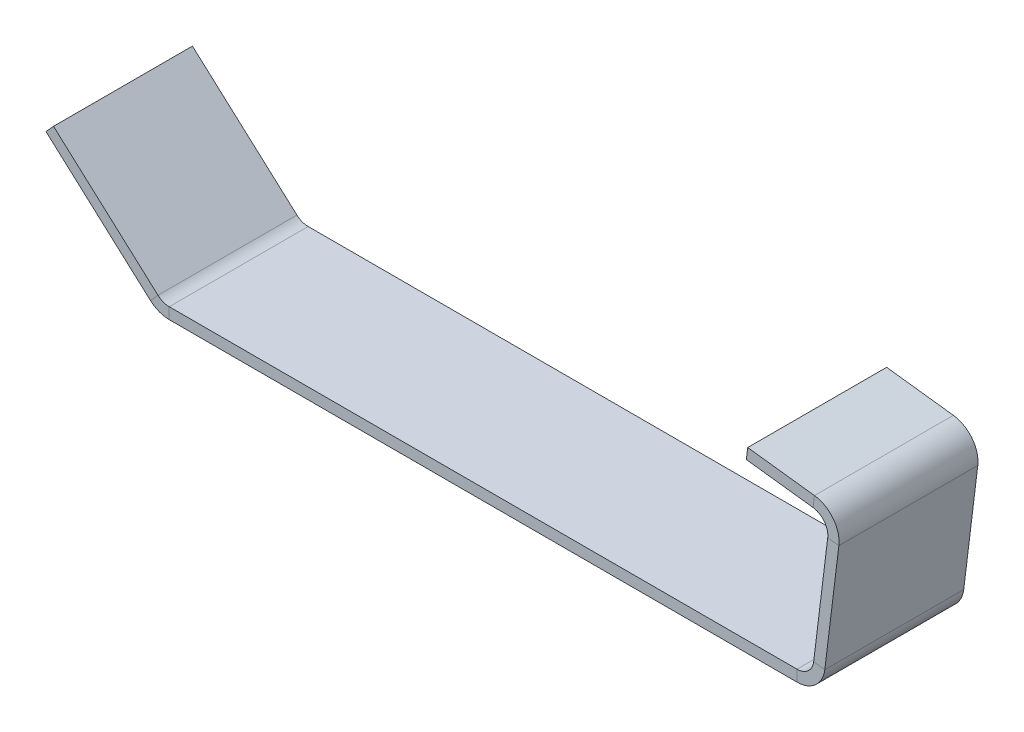
ISO-10303-21;
HEADER;
FILE_DESCRIPTION(('STEP AP214'),'2;1');
FILE_NAME('part.step','',(''),(''),'','','');
FILE_SCHEMA(('AUTOMOTIVE_DESIGN { 1 0 10303 214 1 1 1 1 }'));
ENDSEC;
DATA;
#1=APPLICATION_CONTEXT('core data for automotive mechanical design processes');
#2=APPLICATION_PROTOCOL_DEFINITION('international standard','automotive_design',2000,#1);
#3=PRODUCT_CONTEXT('',#1,'mechanical');
#4=PRODUCT('Part','Part','',(#3));
#5=PRODUCT_RELATED_PRODUCT_CATEGORY('part','',(#4));
#6=PRODUCT_DEFINITION_FORMATION('','',#4);
#7=PRODUCT_DEFINITION_CONTEXT('part definition',#1,'design');
#8=PRODUCT_DEFINITION('design','',#6,#7);
#9=PRODUCT_DEFINITION_SHAPE('','',#8);
#10=(LENGTH_UNIT() NAMED_UNIT(*) SI_UNIT(.MILLI.,.METRE.));
#11=(NAMED_UNIT(*) PLANE_ANGLE_UNIT() SI_UNIT($,.RADIAN.));
#12=(NAMED_UNIT(*) SI_UNIT($,.STERADIAN.) SOLID_ANGLE_UNIT());
#13=UNCERTAINTY_MEASURE_WITH_UNIT(LENGTH_MEASURE(1.E-05),#10,'distance_accuracy_value','');
#14=(GEOMETRIC_REPRESENTATION_CONTEXT(3) GLOBAL_UNCERTAINTY_ASSIGNED_CONTEXT((#13)) GLOBAL_UNIT_ASSIGNED_CONTEXT((#10,
#11,#12)) REPRESENTATION_CONTEXT('',''));
#15=CARTESIAN_POINT('',(0.,0.,0.));
#16=DIRECTION('',(0.,0.,1.));
#17=DIRECTION('',(1.,0.,0.));
#18=AXIS2_PLACEMENT_3D('',#15,#16,#17);
#19=CARTESIAN_POINT('',(0.,-2.,-24.7881355932203));
#20=DIRECTION('',(0.,0.,-1.));
#21=DIRECTION('',(-1.,0.,0.));
#22=AXIS2_PLACEMENT_3D('',#19,#20,#21);
#23=PLANE('',#22);
#24=DIRECTION('',(-1.,0.,0.));
#25=VECTOR('',#24,1.);
#26=CARTESIAN_POINT('',(0.,0.,-24.7881355932203));
#27=LINE('',#26,#25);
#28=CARTESIAN_POINT('',(112.,0.,-24.7881355932203));
#29=VERTEX_POINT('',#28);
#30=CARTESIAN_POINT('',(0.,0.,-24.7881355932203));
#31=VERTEX_POINT('',#30);
#32=EDGE_CURVE('E145',#29,#31,#27,.T.);
#33=ORIENTED_EDGE('',*,*,#32,.F.);
#34=DIRECTION('',(0.,1.,0.));
#35=VECTOR('',#34,1.);
#36=CARTESIAN_POINT('',(112.,-2.,-24.7881355932203));
#37=LINE('',#36,#35);
#38=CARTESIAN_POINT('',(112.,-1.99999999999999,-24.7881355932203));
#39=VERTEX_POINT('',#38);
#40=EDGE_CURVE('E113',#39,#29,#37,.T.);
#41=ORIENTED_EDGE('',*,*,#40,.F.);
#42=DIRECTION('',(-1.,0.,0.));
#43=VECTOR('',#42,1.);
#44=CARTESIAN_POINT('',(0.,-2.,-24.7881355932203));
#45=LINE('',#44,#43);
#46=CARTESIAN_POINT('',(0.,-2.,-24.7881355932203));
#47=VERTEX_POINT('',#46);
#48=EDGE_CURVE('E147',#39,#47,#45,.T.);
#49=ORIENTED_EDGE('',*,*,#48,.T.);
#50=DIRECTION('',(0.,1.,0.));
#51=VECTOR('',#50,1.);
#52=CARTESIAN_POINT('',(0.,-2.,-24.7881355932203));
#53=LINE('',#52,#51);
#54=EDGE_CURVE('E13',#47,#31,#53,.T.);
#55=ORIENTED_EDGE('',*,*,#54,.T.);
#56=EDGE_LOOP('',(#33,#41,#49,#55));
#57=FACE_BOUND('',#56,.T.);
#58=ADVANCED_FACE('F103',(#57),#23,.T.);
#59=CARTESIAN_POINT('',(0.,-2.,0.));
#60=DIRECTION('',(0.,0.,1.));
#61=DIRECTION('',(1.,0.,0.));
#62=AXIS2_PLACEMENT_3D('',#59,#60,#61);
#63=PLANE('',#62);
#64=DIRECTION('',(1.,0.,0.));
#65=VECTOR('',#64,1.);
#66=CARTESIAN_POINT('',(0.,0.,0.));
#67=LINE('',#66,#65);
#68=CARTESIAN_POINT('',(0.,0.,0.));
#69=VERTEX_POINT('',#68);
#70=CARTESIAN_POINT('',(112.,0.,0.));
#71=VERTEX_POINT('',#70);
#72=EDGE_CURVE('E168',#69,#71,#67,.T.);
#73=ORIENTED_EDGE('',*,*,#72,.F.);
#74=DIRECTION('',(0.,1.,0.));
#75=VECTOR('',#74,1.);
#76=CARTESIAN_POINT('',(0.,-2.,0.));
#77=LINE('',#76,#75);
#78=CARTESIAN_POINT('',(0.,-2.,0.));
#79=VERTEX_POINT('',#78);
#80=EDGE_CURVE('E107',#79,#69,#77,.T.);
#81=ORIENTED_EDGE('',*,*,#80,.F.);
#82=DIRECTION('',(1.,0.,0.));
#83=VECTOR('',#82,1.);
#84=CARTESIAN_POINT('',(0.,-2.,0.));
#85=LINE('',#84,#83);
#86=CARTESIAN_POINT('',(112.,-2.,0.));
#87=VERTEX_POINT('',#86);
#88=EDGE_CURVE('E280',#79,#87,#85,.T.);
#89=ORIENTED_EDGE('',*,*,#88,.T.);
#90=DIRECTION('',(0.,1.,0.));
#91=VECTOR('',#90,1.);
#92=CARTESIAN_POINT('',(112.,-2.,0.));
#93=LINE('',#92,#91);
#94=EDGE_CURVE('E289',#87,#71,#93,.T.);
#95=ORIENTED_EDGE('',*,*,#94,.T.);
#96=EDGE_LOOP('',(#73,#81,#89,#95));
#97=FACE_BOUND('',#96,.T.);
#98=ADVANCED_FACE('F105',(#97),#63,.T.);
#99=CARTESIAN_POINT('',(0.,-2.,0.));
#100=DIRECTION('',(0.,-1.,0.));
#101=DIRECTION('',(0.,0.,-1.));
#102=AXIS2_PLACEMENT_3D('',#99,#100,#101);
#103=PLANE('',#102);
#104=DIRECTION('',(0.,0.,1.));
#105=VECTOR('',#104,1.);
#106=CARTESIAN_POINT('',(0.,-2.,0.));
#107=LINE('',#106,#105);
#108=EDGE_CURVE('E122',#47,#79,#107,.T.);
#109=ORIENTED_EDGE('',*,*,#108,.F.);
#110=ORIENTED_EDGE('',*,*,#48,.F.);
#111=DIRECTION('',(0.,0.,-1.));
#112=VECTOR('',#111,1.);
#113=CARTESIAN_POINT('',(112.,-2.,0.));
#114=LINE('',#113,#112);
#115=EDGE_CURVE('E283',#87,#39,#114,.T.);
#116=ORIENTED_EDGE('',*,*,#115,.F.);
#117=ORIENTED_EDGE('',*,*,#88,.F.);
#118=EDGE_LOOP('',(#109,#110,#116,#117));
#119=FACE_BOUND('',#118,.T.);
#120=ADVANCED_FACE('F468',(#119),#103,.T.);
#121=CARTESIAN_POINT('',(0.,0.,0.));
#122=DIRECTION('',(0.,-1.,0.));
#123=DIRECTION('',(0.,0.,-1.));
#124=AXIS2_PLACEMENT_3D('',#121,#122,#123);
#125=PLANE('',#124);
#126=DIRECTION('',(0.,0.,1.));
#127=VECTOR('',#126,1.);
#128=CARTESIAN_POINT('',(0.,0.,0.));
#129=LINE('',#128,#127);
#130=EDGE_CURVE('E155',#31,#69,#129,.T.);
#131=ORIENTED_EDGE('',*,*,#130,.T.);
#132=ORIENTED_EDGE('',*,*,#72,.T.);
#133=DIRECTION('',(0.,0.,-1.));
#134=VECTOR('',#133,1.);
#135=CARTESIAN_POINT('',(112.,0.,0.));
#136=LINE('',#135,#134);
#137=EDGE_CURVE('E140',#71,#29,#136,.T.);
#138=ORIENTED_EDGE('',*,*,#137,.T.);
#139=ORIENTED_EDGE('',*,*,#32,.T.);
#140=EDGE_LOOP('',(#131,#132,#138,#139));
#141=FACE_BOUND('',#140,.T.);
#142=ADVANCED_FACE('F154',(#141),#125,.F.);
#143=CARTESIAN_POINT('',(112.,3.,0.));
#144=DIRECTION('',(0.,0.,1.));
#145=DIRECTION('',(1.,0.,0.));
#146=AXIS2_PLACEMENT_3D('',#143,#144,#145);
#147=PLANE('',#146);
#148=DIRECTION('',(-0.992546151641322,0.121869343405151,0.));
#149=VECTOR('',#148,1.);
#150=CARTESIAN_POINT('',(116.962730758207,2.39065328297424,0.));
#151=LINE('',#150,#149);
#152=CARTESIAN_POINT('',(114.977638454924,2.63439196978455,0.));
#153=VERTEX_POINT('',#152);
#154=CARTESIAN_POINT('',(116.962730758207,2.39065328297424,0.));
#155=VERTEX_POINT('',#154);
#156=EDGE_CURVE('E224',#153,#155,#151,.F.);
#157=ORIENTED_EDGE('',*,*,#156,.F.);
#158=CARTESIAN_POINT('',(112.,3.,0.));
#159=DIRECTION('',(0.,0.,-1.));
#160=DIRECTION('',(-1.,0.,0.));
#161=AXIS2_PLACEMENT_3D('',#158,#159,#160);
#162=CIRCLE('',#161,2.99999999999999);
#163=EDGE_CURVE('E274',#71,#153,#162,.F.);
#164=ORIENTED_EDGE('',*,*,#163,.F.);
#165=ORIENTED_EDGE('',*,*,#94,.F.);
#166=CARTESIAN_POINT('',(112.,3.,0.));
#167=DIRECTION('',(0.,0.,-1.));
#168=DIRECTION('',(-1.,0.,0.));
#169=AXIS2_PLACEMENT_3D('',#166,#167,#168);
#170=CIRCLE('',#169,4.99999999999999);
#171=EDGE_CURVE('E169',#87,#155,#170,.F.);
#172=ORIENTED_EDGE('',*,*,#171,.T.);
#173=EDGE_LOOP('',(#157,#164,#165,#172));
#174=FACE_BOUND('',#173,.T.);
#175=ADVANCED_FACE('F472',(#174),#147,.T.);
#176=CARTESIAN_POINT('',(112.,3.,-24.7881355932203));
#177=DIRECTION('',(0.,0.,1.));
#178=DIRECTION('',(1.,0.,0.));
#179=AXIS2_PLACEMENT_3D('',#176,#177,#178);
#180=PLANE('',#179);
#181=CARTESIAN_POINT('',(112.,3.,-24.7881355932203));
#182=DIRECTION('',(0.,0.,-1.));
#183=DIRECTION('',(-1.,0.,0.));
#184=AXIS2_PLACEMENT_3D('',#181,#182,#183);
#185=CIRCLE('',#184,2.99999999999999);
#186=CARTESIAN_POINT('',(114.977638454924,2.63439196978455,-24.7881355932203));
#187=VERTEX_POINT('',#186);
#188=EDGE_CURVE('E236',#187,#29,#185,.T.);
#189=ORIENTED_EDGE('',*,*,#188,.F.);
#190=DIRECTION('',(-0.992546151641322,0.121869343405151,0.));
#191=VECTOR('',#190,1.);
#192=CARTESIAN_POINT('',(114.977638454924,2.63439196978454,-24.7881355932203));
#193=LINE('',#192,#191);
#194=CARTESIAN_POINT('',(116.962730758207,2.39065328297424,-24.7881355932203));
#195=VERTEX_POINT('',#194);
#196=EDGE_CURVE('E261',#187,#195,#193,.F.);
#197=ORIENTED_EDGE('',*,*,#196,.T.);
#198=CARTESIAN_POINT('',(112.,3.,-24.7881355932203));
#199=DIRECTION('',(0.,0.,-1.));
#200=DIRECTION('',(-1.,0.,0.));
#201=AXIS2_PLACEMENT_3D('',#198,#199,#200);
#202=CIRCLE('',#201,4.99999999999999);
#203=EDGE_CURVE('E271',#195,#39,#202,.T.);
#204=ORIENTED_EDGE('',*,*,#203,.T.);
#205=ORIENTED_EDGE('',*,*,#40,.T.);
#206=EDGE_LOOP('',(#189,#197,#204,#205));
#207=FACE_BOUND('',#206,.T.);
#208=ADVANCED_FACE('F412',(#207),#180,.F.);
#209=CARTESIAN_POINT('',(112.,3.,-24.7881355932203));
#210=DIRECTION('',(0.,0.,-1.));
#211=DIRECTION('',(0.992546151641322,-0.121869343405151,0.));
#212=AXIS2_PLACEMENT_3D('',#209,#210,#211);
#213=CYLINDRICAL_SURFACE('',#212,4.99999999999999);
#214=ORIENTED_EDGE('',*,*,#115,.T.);
#215=ORIENTED_EDGE('',*,*,#203,.F.);
#216=DIRECTION('',(0.,0.,-1.));
#217=VECTOR('',#216,1.);
#218=CARTESIAN_POINT('',(116.962730758207,2.39065328297424,0.));
#219=LINE('',#218,#217);
#220=EDGE_CURVE('E258',#195,#155,#219,.F.);
#221=ORIENTED_EDGE('',*,*,#220,.T.);
#222=ORIENTED_EDGE('',*,*,#171,.F.);
#223=EDGE_LOOP('',(#214,#215,#221,#222));
#224=FACE_BOUND('',#223,.T.);
#225=ADVANCED_FACE('F477',(#224),#213,.T.);
#226=CARTESIAN_POINT('',(112.,3.,-24.7881355932203));
#227=DIRECTION('',(0.,0.,-1.));
#228=DIRECTION('',(0.992546151641322,-0.121869343405151,0.));
#229=AXIS2_PLACEMENT_3D('',#226,#227,#228);
#230=CYLINDRICAL_SURFACE('',#229,2.99999999999999);
#231=ORIENTED_EDGE('',*,*,#137,.F.);
#232=ORIENTED_EDGE('',*,*,#163,.T.);
#233=DIRECTION('',(0.,0.,-1.));
#234=VECTOR('',#233,1.);
#235=CARTESIAN_POINT('',(114.977638454924,2.63439196978455,0.));
#236=LINE('',#235,#234);
#237=EDGE_CURVE('E264',#153,#187,#236,.T.);
#238=ORIENTED_EDGE('',*,*,#237,.T.);
#239=ORIENTED_EDGE('',*,*,#188,.T.);
#240=EDGE_LOOP('',(#231,#232,#238,#239));
#241=FACE_BOUND('',#240,.T.);
#242=ADVANCED_FACE('F405',(#241),#230,.F.);
#243=CARTESIAN_POINT('',(119.470359907908,22.813653791033,-24.7881355932203));
#244=DIRECTION('',(0.,0.,1.));
#245=DIRECTION('',(0.,-1.,0.));
#246=AXIS2_PLACEMENT_3D('',#243,#244,#245);
#247=PLANE('',#246);
#248=ORIENTED_EDGE('',*,*,#196,.F.);
#249=DIRECTION('',(-0.121869343405151,-0.992546151641322,0.));
#250=VECTOR('',#249,1.);
#251=CARTESIAN_POINT('',(117.485267604626,23.0573924778433,-24.7881355932203));
#252=LINE('',#251,#250);
#253=CARTESIAN_POINT('',(117.485267604626,23.0573924778433,-24.7881355932203));
#254=VERTEX_POINT('',#253);
#255=EDGE_CURVE('E255',#187,#254,#252,.F.);
#256=ORIENTED_EDGE('',*,*,#255,.T.);
#257=DIRECTION('',(-0.992546151641322,0.121869343405151,0.));
#258=VECTOR('',#257,1.);
#259=CARTESIAN_POINT('',(119.470359907908,22.813653791033,-24.7881355932203));
#260=LINE('',#259,#258);
#261=CARTESIAN_POINT('',(119.470359907909,22.813653791033,-24.7881355932203));
#262=VERTEX_POINT('',#261);
#263=EDGE_CURVE('E233',#262,#254,#260,.T.);
#264=ORIENTED_EDGE('',*,*,#263,.F.);
#265=DIRECTION('',(0.121869343405151,0.992546151641322,0.));
#266=VECTOR('',#265,1.);
#267=CARTESIAN_POINT('',(114.975828768406,-13.7913648403921,-24.7881355932203));
#268=LINE('',#267,#266);
#269=EDGE_CURVE('E246',#195,#262,#268,.T.);
#270=ORIENTED_EDGE('',*,*,#269,.F.);
#271=EDGE_LOOP('',(#248,#256,#264,#270));
#272=FACE_BOUND('',#271,.T.);
#273=ADVANCED_FACE('F416',(#272),#247,.F.);
#274=CARTESIAN_POINT('',(116.63926809695,-0.243738686810304,0.));
#275=DIRECTION('',(0.,0.,-1.));
#276=DIRECTION('',(-1.,0.,0.));
#277=AXIS2_PLACEMENT_3D('',#274,#275,#276);
#278=PLANE('',#277);
#279=ORIENTED_EDGE('',*,*,#156,.T.);
#280=DIRECTION('',(-0.121869343405151,-0.992546151641322,0.));
#281=VECTOR('',#280,1.);
#282=CARTESIAN_POINT('',(114.975828768406,-13.7913648403921,0.));
#283=LINE('',#282,#281);
#284=CARTESIAN_POINT('',(119.470359907908,22.813653791033,0.));
#285=VERTEX_POINT('',#284);
#286=EDGE_CURVE('E240',#285,#155,#283,.T.);
#287=ORIENTED_EDGE('',*,*,#286,.F.);
#288=DIRECTION('',(-0.992546151641322,0.121869343405151,0.));
#289=VECTOR('',#288,1.);
#290=CARTESIAN_POINT('',(119.470359907908,22.813653791033,0.));
#291=LINE('',#290,#289);
#292=CARTESIAN_POINT('',(117.485267604626,23.0573924778433,0.));
#293=VERTEX_POINT('',#292);
#294=EDGE_CURVE('E237',#285,#293,#291,.T.);
#295=ORIENTED_EDGE('',*,*,#294,.T.);
#296=DIRECTION('',(0.121869343405151,0.992546151641322,0.));
#297=VECTOR('',#296,1.);
#298=CARTESIAN_POINT('',(114.654175793668,0.,0.));
#299=LINE('',#298,#297);
#300=EDGE_CURVE('E249',#293,#153,#299,.F.);
#301=ORIENTED_EDGE('',*,*,#300,.T.);
#302=EDGE_LOOP('',(#279,#287,#295,#301));
#303=FACE_BOUND('',#302,.T.);
#304=ADVANCED_FACE('F430',(#303),#278,.F.);
#305=CARTESIAN_POINT('',(114.975828768406,-13.7913648403921,0.));
#306=DIRECTION('',(-0.992546151641322,0.121869343405151,0.));
#307=DIRECTION('',(-0.121869343405151,-0.992546151641322,0.));
#308=AXIS2_PLACEMENT_3D('',#305,#306,#307);
#309=PLANE('',#308);
#310=ORIENTED_EDGE('',*,*,#220,.F.);
#311=ORIENTED_EDGE('',*,*,#269,.T.);
#312=DIRECTION('',(0.,0.,1.));
#313=VECTOR('',#312,1.);
#314=CARTESIAN_POINT('',(119.470359907908,22.813653791033,0.));
#315=LINE('',#314,#313);
#316=EDGE_CURVE('E243',#262,#285,#315,.T.);
#317=ORIENTED_EDGE('',*,*,#316,.T.);
#318=ORIENTED_EDGE('',*,*,#286,.T.);
#319=EDGE_LOOP('',(#310,#311,#317,#318));
#320=FACE_BOUND('',#319,.T.);
#321=ADVANCED_FACE('F432',(#320),#309,.F.);
#322=CARTESIAN_POINT('',(112.990736465124,-13.5476261535818,0.));
#323=DIRECTION('',(-0.992546151641322,0.121869343405151,0.));
#324=DIRECTION('',(-0.121869343405151,-0.992546151641322,0.));
#325=AXIS2_PLACEMENT_3D('',#322,#323,#324);
#326=PLANE('',#325);
#327=ORIENTED_EDGE('',*,*,#255,.F.);
#328=ORIENTED_EDGE('',*,*,#237,.F.);
#329=ORIENTED_EDGE('',*,*,#300,.F.);
#330=DIRECTION('',(0.,0.,-1.));
#331=VECTOR('',#330,1.);
#332=CARTESIAN_POINT('',(117.485267604626,23.0573924778433,0.));
#333=LINE('',#332,#331);
#334=EDGE_CURVE('E252',#254,#293,#333,.F.);
#335=ORIENTED_EDGE('',*,*,#334,.F.);
#336=EDGE_LOOP('',(#327,#328,#329,#335));
#337=FACE_BOUND('',#336,.T.);
#338=ADVANCED_FACE('F419',(#337),#326,.T.);
#339=CARTESIAN_POINT('',(114.507629149702,23.4230005080588,0.));
#340=DIRECTION('',(0.,0.,1.));
#341=DIRECTION('',(1.,0.,0.));
#342=AXIS2_PLACEMENT_3D('',#339,#340,#341);
#343=PLANE('',#342);
#344=DIRECTION('',(0.121869343405155,0.992546151641321,0.));
#345=VECTOR('',#344,1.);
#346=CARTESIAN_POINT('',(115.116975866728,28.3857312662654,0.));
#347=LINE('',#346,#345);
#348=CARTESIAN_POINT('',(114.873237179917,26.4006389629828,0.));
#349=VERTEX_POINT('',#348);
#350=CARTESIAN_POINT('',(115.116975866728,28.3857312662654,0.));
#351=VERTEX_POINT('',#350);
#352=EDGE_CURVE('E218',#349,#351,#347,.T.);
#353=ORIENTED_EDGE('',*,*,#352,.F.);
#354=CARTESIAN_POINT('',(114.507629149702,23.4230005080588,0.));
#355=DIRECTION('',(0.,0.,-1.));
#356=DIRECTION('',(-1.,0.,0.));
#357=AXIS2_PLACEMENT_3D('',#354,#355,#356);
#358=CIRCLE('',#357,3.);
#359=EDGE_CURVE('E228',#293,#349,#358,.F.);
#360=ORIENTED_EDGE('',*,*,#359,.F.);
#361=ORIENTED_EDGE('',*,*,#294,.F.);
#362=CARTESIAN_POINT('',(114.507629149702,23.4230005080588,0.));
#363=DIRECTION('',(0.,0.,-1.));
#364=DIRECTION('',(-1.,0.,0.));
#365=AXIS2_PLACEMENT_3D('',#362,#363,#364);
#366=CIRCLE('',#365,5.);
#367=EDGE_CURVE('E221',#285,#351,#366,.F.);
#368=ORIENTED_EDGE('',*,*,#367,.T.);
#369=EDGE_LOOP('',(#353,#360,#361,#368));
#370=FACE_BOUND('',#369,.T.);
#371=ADVANCED_FACE('F427',(#370),#343,.T.);
#372=CARTESIAN_POINT('',(114.507629149702,23.4230005080588,-24.7881355932203));
#373=DIRECTION('',(0.,0.,1.));
#374=DIRECTION('',(1.,0.,0.));
#375=AXIS2_PLACEMENT_3D('',#372,#373,#374);
#376=PLANE('',#375);
#377=CARTESIAN_POINT('',(114.507629149702,23.4230005080588,-24.7881355932203));
#378=DIRECTION('',(0.,0.,-1.));
#379=DIRECTION('',(-1.,0.,0.));
#380=AXIS2_PLACEMENT_3D('',#377,#378,#379);
#381=CIRCLE('',#380,3.);
#382=CARTESIAN_POINT('',(114.873237179917,26.4006389629828,-24.7881355932203));
#383=VERTEX_POINT('',#382);
#384=EDGE_CURVE('E187',#383,#254,#381,.T.);
#385=ORIENTED_EDGE('',*,*,#384,.F.);
#386=DIRECTION('',(0.121869343405155,0.992546151641321,0.));
#387=VECTOR('',#386,1.);
#388=CARTESIAN_POINT('',(114.873237179917,26.4006389629828,-24.7881355932203));
#389=LINE('',#388,#387);
#390=CARTESIAN_POINT('',(115.116975866728,28.3857312662654,-24.7881355932203));
#391=VERTEX_POINT('',#390);
#392=EDGE_CURVE('E212',#383,#391,#389,.T.);
#393=ORIENTED_EDGE('',*,*,#392,.T.);
#394=CARTESIAN_POINT('',(114.507629149702,23.4230005080588,-24.7881355932203));
#395=DIRECTION('',(0.,0.,-1.));
#396=DIRECTION('',(-1.,0.,0.));
#397=AXIS2_PLACEMENT_3D('',#394,#395,#396);
#398=CIRCLE('',#397,5.);
#399=EDGE_CURVE('E225',#391,#262,#398,.T.);
#400=ORIENTED_EDGE('',*,*,#399,.T.);
#401=ORIENTED_EDGE('',*,*,#263,.T.);
#402=EDGE_LOOP('',(#385,#393,#400,#401));
#403=FACE_BOUND('',#402,.T.);
#404=ADVANCED_FACE('F436',(#403),#376,.F.);
#405=CARTESIAN_POINT('',(114.507629149702,23.4230005080588,-24.7881355932203));
#406=DIRECTION('',(0.,0.,-1.));
#407=DIRECTION('',(0.121869343405155,0.992546151641321,0.));
#408=AXIS2_PLACEMENT_3D('',#405,#406,#407);
#409=CYLINDRICAL_SURFACE('',#408,5.);
#410=ORIENTED_EDGE('',*,*,#316,.F.);
#411=ORIENTED_EDGE('',*,*,#399,.F.);
#412=DIRECTION('',(0.,0.,-1.));
#413=VECTOR('',#412,1.);
#414=CARTESIAN_POINT('',(115.116975866728,28.3857312662654,1.18458590070572E-13));
#415=LINE('',#414,#413);
#416=EDGE_CURVE('E209',#351,#391,#415,.T.);
#417=ORIENTED_EDGE('',*,*,#416,.F.);
#418=ORIENTED_EDGE('',*,*,#367,.F.);
#419=EDGE_LOOP('',(#410,#411,#417,#418));
#420=FACE_BOUND('',#419,.T.);
#421=ADVANCED_FACE('F434',(#420),#409,.T.);
#422=CARTESIAN_POINT('',(114.507629149702,23.4230005080588,-24.7881355932203));
#423=DIRECTION('',(0.,0.,-1.));
#424=DIRECTION('',(0.121869343405155,0.992546151641321,0.));
#425=AXIS2_PLACEMENT_3D('',#422,#423,#424);
#426=CYLINDRICAL_SURFACE('',#425,3.);
#427=ORIENTED_EDGE('',*,*,#334,.T.);
#428=ORIENTED_EDGE('',*,*,#359,.T.);
#429=DIRECTION('',(0.,0.,1.));
#430=VECTOR('',#429,1.);
#431=CARTESIAN_POINT('',(114.873237179917,26.4006389629828,0.));
#432=LINE('',#431,#430);
#433=EDGE_CURVE('E215',#349,#383,#432,.F.);
#434=ORIENTED_EDGE('',*,*,#433,.T.);
#435=ORIENTED_EDGE('',*,*,#384,.T.);
#436=EDGE_LOOP('',(#427,#428,#434,#435));
#437=FACE_BOUND('',#436,.T.);
#438=ADVANCED_FACE('F422',(#437),#426,.F.);
#439=CARTESIAN_POINT('',(118.094614321652,28.0201232360499,-24.7881355932203));
#440=DIRECTION('',(0.,0.,-1.));
#441=DIRECTION('',(-1.,0.,0.));
#442=AXIS2_PLACEMENT_3D('',#439,#440,#441);
#443=PLANE('',#442);
#444=DIRECTION('',(0.992546151641321,-0.121869343405155,0.));
#445=VECTOR('',#444,1.);
#446=CARTESIAN_POINT('',(118.094614321652,28.0201232360499,-24.7881355932203));
#447=LINE('',#446,#445);
#448=CARTESIAN_POINT('',(103.206422047032,29.8481633871273,-24.7881355932203));
#449=VERTEX_POINT('',#448);
#450=EDGE_CURVE('E191',#449,#391,#447,.T.);
#451=ORIENTED_EDGE('',*,*,#450,.T.);
#452=ORIENTED_EDGE('',*,*,#392,.F.);
#453=DIRECTION('',(-0.992546151641321,0.121869343405155,0.));
#454=VECTOR('',#453,1.);
#455=CARTESIAN_POINT('',(4.89955935186121,39.9037087059789,-24.7881355932199));
#456=LINE('',#455,#454);
#457=CARTESIAN_POINT('',(102.962683360221,27.8630710838446,-24.7881355932203));
#458=VERTEX_POINT('',#457);
#459=EDGE_CURVE('E200',#458,#383,#456,.F.);
#460=ORIENTED_EDGE('',*,*,#459,.F.);
#461=DIRECTION('',(-0.121869343405155,-0.992546151641321,0.));
#462=VECTOR('',#461,1.);
#463=CARTESIAN_POINT('',(103.206422047032,29.8481633871273,-24.7881355932203));
#464=LINE('',#463,#462);
#465=EDGE_CURVE('E184',#449,#458,#464,.T.);
#466=ORIENTED_EDGE('',*,*,#465,.F.);
#467=EDGE_LOOP('',(#451,#452,#460,#466));
#468=FACE_BOUND('',#467,.T.);
#469=ADVANCED_FACE('F445',(#468),#443,.T.);
#470=CARTESIAN_POINT('',(103.206422047032,29.8481633871273,0.));
#471=DIRECTION('',(0.,0.,1.));
#472=DIRECTION('',(1.,0.,0.));
#473=AXIS2_PLACEMENT_3D('',#470,#471,#472);
#474=PLANE('',#473);
#475=DIRECTION('',(0.992546151641321,-0.121869343405155,0.));
#476=VECTOR('',#475,1.);
#477=CARTESIAN_POINT('',(4.89955935186131,39.9037087059789,4.35978058744953E-13));
#478=LINE('',#477,#476);
#479=CARTESIAN_POINT('',(102.962683360221,27.8630710838446,0.));
#480=VERTEX_POINT('',#479);
#481=EDGE_CURVE('E206',#349,#480,#478,.F.);
#482=ORIENTED_EDGE('',*,*,#481,.F.);
#483=ORIENTED_EDGE('',*,*,#352,.T.);
#484=DIRECTION('',(-0.992546151641321,0.121869343405155,0.));
#485=VECTOR('',#484,1.);
#486=CARTESIAN_POINT('',(103.206422047032,29.8481633871273,0.));
#487=LINE('',#486,#485);
#488=CARTESIAN_POINT('',(103.206422047032,29.8481633871273,0.));
#489=VERTEX_POINT('',#488);
#490=EDGE_CURVE('E197',#351,#489,#487,.T.);
#491=ORIENTED_EDGE('',*,*,#490,.T.);
#492=DIRECTION('',(-0.121869343405155,-0.992546151641321,0.));
#493=VECTOR('',#492,1.);
#494=CARTESIAN_POINT('',(103.206422047032,29.8481633871273,0.));
#495=LINE('',#494,#493);
#496=EDGE_CURVE('E188',#489,#480,#495,.T.);
#497=ORIENTED_EDGE('',*,*,#496,.T.);
#498=EDGE_LOOP('',(#482,#483,#491,#497));
#499=FACE_BOUND('',#498,.T.);
#500=ADVANCED_FACE('F452',(#499),#474,.T.);
#501=CARTESIAN_POINT('',(5.14329803867162,41.8888010092616,0.));
#502=DIRECTION('',(0.121869343405155,0.992546151641321,0.));
#503=DIRECTION('',(-0.992546151641321,0.121869343405155,0.));
#504=AXIS2_PLACEMENT_3D('',#501,#502,#503);
#505=PLANE('',#504);
#506=ORIENTED_EDGE('',*,*,#490,.F.);
#507=ORIENTED_EDGE('',*,*,#416,.T.);
#508=ORIENTED_EDGE('',*,*,#450,.F.);
#509=DIRECTION('',(0.,0.,-1.));
#510=VECTOR('',#509,1.);
#511=CARTESIAN_POINT('',(103.206422047032,29.8481633871273,-24.7881355932203));
#512=LINE('',#511,#510);
#513=EDGE_CURVE('E194',#489,#449,#512,.T.);
#514=ORIENTED_EDGE('',*,*,#513,.F.);
#515=EDGE_LOOP('',(#506,#507,#508,#514));
#516=FACE_BOUND('',#515,.T.);
#517=ADVANCED_FACE('F443',(#516),#505,.T.);
#518=CARTESIAN_POINT('',(4.89955935186131,39.9037087059789,0.));
#519=DIRECTION('',(0.121869343405155,0.992546151641321,0.));
#520=DIRECTION('',(-0.992546151641321,0.121869343405155,0.));
#521=AXIS2_PLACEMENT_3D('',#518,#519,#520);
#522=PLANE('',#521);
#523=ORIENTED_EDGE('',*,*,#433,.F.);
#524=ORIENTED_EDGE('',*,*,#481,.T.);
#525=DIRECTION('',(0.,0.,1.));
#526=VECTOR('',#525,1.);
#527=CARTESIAN_POINT('',(102.962683360221,27.8630710838446,0.));
#528=LINE('',#527,#526);
#529=EDGE_CURVE('E203',#480,#458,#528,.F.);
#530=ORIENTED_EDGE('',*,*,#529,.T.);
#531=ORIENTED_EDGE('',*,*,#459,.T.);
#532=EDGE_LOOP('',(#523,#524,#530,#531));
#533=FACE_BOUND('',#532,.T.);
#534=ADVANCED_FACE('F454',(#533),#522,.F.);
#535=CARTESIAN_POINT('',(103.206422047032,29.8481633871273,-24.7881355932203));
#536=DIRECTION('',(-0.992546151641321,0.121869343405155,0.));
#537=DIRECTION('',(-0.121869343405155,-0.992546151641321,0.));
#538=AXIS2_PLACEMENT_3D('',#535,#536,#537);
#539=PLANE('',#538);
#540=ORIENTED_EDGE('',*,*,#529,.F.);
#541=ORIENTED_EDGE('',*,*,#496,.F.);
#542=ORIENTED_EDGE('',*,*,#513,.T.);
#543=ORIENTED_EDGE('',*,*,#465,.T.);
#544=EDGE_LOOP('',(#540,#541,#542,#543));
#545=FACE_BOUND('',#544,.T.);
#546=ADVANCED_FACE('F449',(#545),#539,.T.);
#547=CARTESIAN_POINT('',(0.,3.,-24.7881355932203));
#548=DIRECTION('',(0.,0.,-1.));
#549=DIRECTION('',(-1.,0.,0.));
#550=AXIS2_PLACEMENT_3D('',#547,#548,#549);
#551=PLANE('',#550);
#552=DIRECTION('',(0.669130606358855,0.743144825477397,0.));
#553=VECTOR('',#552,1.);
#554=CARTESIAN_POINT('',(-3.34565303179428,-0.715724127386987,-24.7881355932203));
#555=LINE('',#554,#553);
#556=CARTESIAN_POINT('',(-2.00739181907656,0.770565523567808,-24.7881355932203));
#557=VERTEX_POINT('',#556);
#558=CARTESIAN_POINT('',(-3.34565303179427,-0.715724127386987,-24.7881355932203));
#559=VERTEX_POINT('',#558);
#560=EDGE_CURVE('E174',#557,#559,#555,.F.);
#561=ORIENTED_EDGE('',*,*,#560,.F.);
#562=CARTESIAN_POINT('',(0.,3.,-24.7881355932203));
#563=DIRECTION('',(0.,0.,1.));
#564=DIRECTION('',(1.,0.,0.));
#565=AXIS2_PLACEMENT_3D('',#562,#563,#564);
#566=CIRCLE('',#565,3.);
#567=EDGE_CURVE('E164',#31,#557,#566,.F.);
#568=ORIENTED_EDGE('',*,*,#567,.F.);
#569=ORIENTED_EDGE('',*,*,#54,.F.);
#570=CARTESIAN_POINT('',(0.,3.,-24.7881355932203));
#571=DIRECTION('',(0.,0.,1.));
#572=DIRECTION('',(1.,0.,0.));
#573=AXIS2_PLACEMENT_3D('',#570,#571,#572);
#574=CIRCLE('',#573,5.);
#575=EDGE_CURVE('E178',#47,#559,#574,.F.);
#576=ORIENTED_EDGE('',*,*,#575,.T.);
#577=EDGE_LOOP('',(#561,#568,#569,#576));
#578=FACE_BOUND('',#577,.T.);
#579=ADVANCED_FACE('F172',(#578),#551,.T.);
#580=CARTESIAN_POINT('',(0.,3.,0.));
#581=DIRECTION('',(0.,0.,-1.));
#582=DIRECTION('',(-1.,0.,0.));
#583=AXIS2_PLACEMENT_3D('',#580,#581,#582);
#584=PLANE('',#583);
#585=CARTESIAN_POINT('',(0.,3.,0.));
#586=DIRECTION('',(0.,0.,1.));
#587=DIRECTION('',(1.,0.,0.));
#588=AXIS2_PLACEMENT_3D('',#585,#586,#587);
#589=CIRCLE('',#588,3.);
#590=CARTESIAN_POINT('',(-2.00739181907656,0.770565523567808,0.));
#591=VERTEX_POINT('',#590);
#592=EDGE_CURVE('E167',#591,#69,#589,.T.);
#593=ORIENTED_EDGE('',*,*,#592,.F.);
#594=DIRECTION('',(0.669130606358855,0.743144825477397,0.));
#595=VECTOR('',#594,1.);
#596=CARTESIAN_POINT('',(-2.00739181907656,0.770565523567808,0.));
#597=LINE('',#596,#595);
#598=CARTESIAN_POINT('',(-3.34565303179427,-0.715724127386987,0.));
#599=VERTEX_POINT('',#598);
#600=EDGE_CURVE('E313',#591,#599,#597,.F.);
#601=ORIENTED_EDGE('',*,*,#600,.T.);
#602=CARTESIAN_POINT('',(0.,3.,0.));
#603=DIRECTION('',(0.,0.,1.));
#604=DIRECTION('',(1.,0.,0.));
#605=AXIS2_PLACEMENT_3D('',#602,#603,#604);
#606=CIRCLE('',#605,5.);
#607=EDGE_CURVE('E175',#599,#79,#606,.T.);
#608=ORIENTED_EDGE('',*,*,#607,.T.);
#609=ORIENTED_EDGE('',*,*,#80,.T.);
#610=EDGE_LOOP('',(#593,#601,#608,#609));
#611=FACE_BOUND('',#610,.T.);
#612=ADVANCED_FACE('F294',(#611),#584,.F.);
#613=CARTESIAN_POINT('',(0.,3.,0.));
#614=DIRECTION('',(0.,0.,1.));
#615=DIRECTION('',(-0.669130606358855,-0.743144825477397,0.));
#616=AXIS2_PLACEMENT_3D('',#613,#614,#615);
#617=CYLINDRICAL_SURFACE('',#616,5.);
#618=ORIENTED_EDGE('',*,*,#108,.T.);
#619=ORIENTED_EDGE('',*,*,#607,.F.);
#620=DIRECTION('',(0.,0.,1.));
#621=VECTOR('',#620,1.);
#622=CARTESIAN_POINT('',(-3.34565303179427,-0.715724127386987,0.));
#623=LINE('',#622,#621);
#624=EDGE_CURVE('E308',#559,#599,#623,.T.);
#625=ORIENTED_EDGE('',*,*,#624,.F.);
#626=ORIENTED_EDGE('',*,*,#575,.F.);
#627=EDGE_LOOP('',(#618,#619,#625,#626));
#628=FACE_BOUND('',#627,.T.);
#629=ADVANCED_FACE('F304',(#628),#617,.T.);
#630=CARTESIAN_POINT('',(0.,3.,0.));
#631=DIRECTION('',(0.,0.,1.));
#632=DIRECTION('',(-0.669130606358855,-0.743144825477397,0.));
#633=AXIS2_PLACEMENT_3D('',#630,#631,#632);
#634=CYLINDRICAL_SURFACE('',#633,3.);
#635=ORIENTED_EDGE('',*,*,#130,.F.);
#636=ORIENTED_EDGE('',*,*,#567,.T.);
#637=DIRECTION('',(0.,0.,-1.));
#638=VECTOR('',#637,1.);
#639=CARTESIAN_POINT('',(-2.00739181907656,0.770565523567808,-24.7881355932203));
#640=LINE('',#639,#638);
#641=EDGE_CURVE('E311',#557,#591,#640,.F.);
#642=ORIENTED_EDGE('',*,*,#641,.T.);
#643=ORIENTED_EDGE('',*,*,#592,.T.);
#644=EDGE_LOOP('',(#635,#636,#642,#643));
#645=FACE_BOUND('',#644,.T.);
#646=ADVANCED_FACE('F161',(#645),#634,.F.);
#647=CARTESIAN_POINT('',(-2.48985331782395,-1.48628965095479,0.));
#648=DIRECTION('',(0.,0.,-1.));
#649=DIRECTION('',(-1.,0.,0.));
#650=AXIS2_PLACEMENT_3D('',#647,#648,#649);
#651=PLANE('',#650);
#652=ORIENTED_EDGE('',*,*,#600,.F.);
#653=DIRECTION('',(-0.743144825477397,0.669130606358855,0.));
#654=VECTOR('',#653,1.);
#655=CARTESIAN_POINT('',(-1.15159210510624,0.,0.));
#656=LINE('',#655,#654);
#657=CARTESIAN_POINT('',(-20.6459692503491,17.5528160226439,0.));
#658=VERTEX_POINT('',#657);
#659=EDGE_CURVE('E316',#591,#658,#656,.T.);
#660=ORIENTED_EDGE('',*,*,#659,.T.);
#661=DIRECTION('',(0.669130606358855,0.743144825477397,0.));
#662=VECTOR('',#661,1.);
#663=CARTESIAN_POINT('',(-21.9842304630668,16.0665263716891,0.));
#664=LINE('',#663,#662);
#665=CARTESIAN_POINT('',(-21.9842304630668,16.0665263716891,0.));
#666=VERTEX_POINT('',#665);
#667=EDGE_CURVE('E180',#666,#658,#664,.T.);
#668=ORIENTED_EDGE('',*,*,#667,.F.);
#669=DIRECTION('',(0.743144825477397,-0.669130606358855,0.));
#670=VECTOR('',#669,1.);
#671=CARTESIAN_POINT('',(-2.48985331782395,-1.48628965095479,0.));
#672=LINE('',#671,#670);
#673=EDGE_CURVE('E325',#599,#666,#672,.F.);
#674=ORIENTED_EDGE('',*,*,#673,.F.);
#675=EDGE_LOOP('',(#652,#660,#668,#674));
#676=FACE_BOUND('',#675,.T.);
#677=ADVANCED_FACE('F592',(#676),#651,.F.);
#678=CARTESIAN_POINT('',(-21.9842304630668,16.0665263716891,-24.7881355932203));
#679=DIRECTION('',(0.,0.,1.));
#680=DIRECTION('',(1.,0.,0.));
#681=AXIS2_PLACEMENT_3D('',#678,#679,#680);
#682=PLANE('',#681);
#683=ORIENTED_EDGE('',*,*,#560,.T.);
#684=DIRECTION('',(-0.743144825477397,0.669130606358855,0.));
#685=VECTOR('',#684,1.);
#686=CARTESIAN_POINT('',(-2.48985331782395,-1.4862896509548,-24.7881355932203));
#687=LINE('',#686,#685);
#688=CARTESIAN_POINT('',(-21.9842304630668,16.0665263716891,-24.7881355932203));
#689=VERTEX_POINT('',#688);
#690=EDGE_CURVE('E331',#689,#559,#687,.F.);
#691=ORIENTED_EDGE('',*,*,#690,.F.);
#692=DIRECTION('',(0.669130606358855,0.743144825477397,0.));
#693=VECTOR('',#692,1.);
#694=CARTESIAN_POINT('',(-21.9842304630668,16.0665263716891,-24.7881355932203));
#695=LINE('',#694,#693);
#696=CARTESIAN_POINT('',(-20.6459692503491,17.5528160226439,-24.7881355932203));
#697=VERTEX_POINT('',#696);
#698=EDGE_CURVE('E334',#689,#697,#695,.T.);
#699=ORIENTED_EDGE('',*,*,#698,.T.);
#700=DIRECTION('',(0.743144825477397,-0.669130606358855,0.));
#701=VECTOR('',#700,1.);
#702=CARTESIAN_POINT('',(-20.6459692503491,17.5528160226439,-24.7881355932203));
#703=LINE('',#702,#701);
#704=EDGE_CURVE('E322',#697,#557,#703,.T.);
#705=ORIENTED_EDGE('',*,*,#704,.T.);
#706=EDGE_LOOP('',(#683,#691,#699,#705));
#707=FACE_BOUND('',#706,.T.);
#708=ADVANCED_FACE('F356',(#707),#682,.F.);
#709=CARTESIAN_POINT('',(-2.48985331782395,-1.48628965095479,0.));
#710=DIRECTION('',(-0.669130606358855,-0.743144825477397,0.));
#711=DIRECTION('',(0.743144825477397,-0.669130606358855,0.));
#712=AXIS2_PLACEMENT_3D('',#709,#710,#711);
#713=PLANE('',#712);
#714=ORIENTED_EDGE('',*,*,#690,.T.);
#715=ORIENTED_EDGE('',*,*,#624,.T.);
#716=ORIENTED_EDGE('',*,*,#673,.T.);
#717=DIRECTION('',(0.,0.,1.));
#718=VECTOR('',#717,1.);
#719=CARTESIAN_POINT('',(-21.9842304630668,16.0665263716891,0.));
#720=LINE('',#719,#718);
#721=EDGE_CURVE('E328',#666,#689,#720,.F.);
#722=ORIENTED_EDGE('',*,*,#721,.T.);
#723=EDGE_LOOP('',(#714,#715,#716,#722));
#724=FACE_BOUND('',#723,.T.);
#725=ADVANCED_FACE('F611',(#724),#713,.T.);
#726=CARTESIAN_POINT('',(-1.15159210510624,0.,0.));
#727=DIRECTION('',(-0.669130606358855,-0.743144825477397,0.));
#728=DIRECTION('',(0.743144825477397,-0.669130606358855,0.));
#729=AXIS2_PLACEMENT_3D('',#726,#727,#728);
#730=PLANE('',#729);
#731=ORIENTED_EDGE('',*,*,#641,.F.);
#732=ORIENTED_EDGE('',*,*,#704,.F.);
#733=DIRECTION('',(0.,0.,-1.));
#734=VECTOR('',#733,1.);
#735=CARTESIAN_POINT('',(-20.6459692503491,17.5528160226439,0.));
#736=LINE('',#735,#734);
#737=EDGE_CURVE('E319',#658,#697,#736,.T.);
#738=ORIENTED_EDGE('',*,*,#737,.F.);
#739=ORIENTED_EDGE('',*,*,#659,.F.);
#740=EDGE_LOOP('',(#731,#732,#738,#739));
#741=FACE_BOUND('',#740,.T.);
#742=ADVANCED_FACE('F352',(#741),#730,.F.);
#743=CARTESIAN_POINT('',(-21.9842304630668,16.0665263716891,0.));
#744=DIRECTION('',(0.743144825477397,-0.669130606358855,0.));
#745=DIRECTION('',(0.669130606358855,0.743144825477397,0.));
#746=AXIS2_PLACEMENT_3D('',#743,#744,#745);
#747=PLANE('',#746);
#748=ORIENTED_EDGE('',*,*,#737,.T.);
#749=ORIENTED_EDGE('',*,*,#698,.F.);
#750=ORIENTED_EDGE('',*,*,#721,.F.);
#751=ORIENTED_EDGE('',*,*,#667,.T.);
#752=EDGE_LOOP('',(#748,#749,#750,#751));
#753=FACE_BOUND('',#752,.T.);
#754=ADVANCED_FACE('F343',(#753),#747,.F.);
#755=CLOSED_SHELL('',(#58,#98,#120,#142,#175,#208,#225,#242,#273,#304,#321,#338,#371,#404,#421,
#438,#469,#500,#517,#534,#546,#579,#612,#629,#646,#677,#708,#725,#742,#754));
#756=MANIFOLD_SOLID_BREP('B2',#755);
#757=ADVANCED_BREP_SHAPE_REPRESENTATION('',(#18,#756),#14);
#758=SHAPE_DEFINITION_REPRESENTATION(#9,#757);
ENDSEC;
END-ISO-10303-21;
